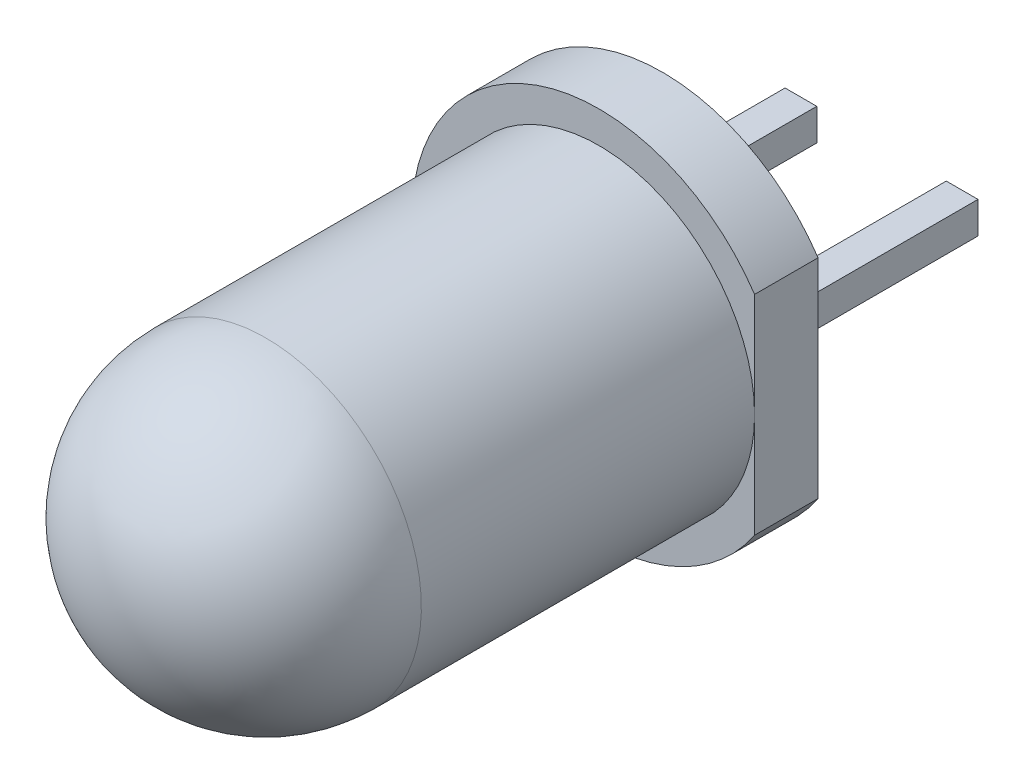
ISO-10303-21;
HEADER;
FILE_DESCRIPTION(('STEP AP214'),'2;1');
FILE_NAME('part.step','',(''),(''),'','','');
FILE_SCHEMA(('AUTOMOTIVE_DESIGN { 1 0 10303 214 1 1 1 1 }'));
ENDSEC;
DATA;
#1=APPLICATION_CONTEXT('core data for automotive mechanical design processes');
#2=APPLICATION_PROTOCOL_DEFINITION('international standard','automotive_design',2000,#1);
#3=PRODUCT_CONTEXT('',#1,'mechanical');
#4=PRODUCT('Part','Part','',(#3));
#5=PRODUCT_RELATED_PRODUCT_CATEGORY('part','',(#4));
#6=PRODUCT_DEFINITION_FORMATION('','',#4);
#7=PRODUCT_DEFINITION_CONTEXT('part definition',#1,'design');
#8=PRODUCT_DEFINITION('design','',#6,#7);
#9=PRODUCT_DEFINITION_SHAPE('','',#8);
#10=(LENGTH_UNIT() NAMED_UNIT(*) SI_UNIT(.MILLI.,.METRE.));
#11=(NAMED_UNIT(*) PLANE_ANGLE_UNIT() SI_UNIT($,.RADIAN.));
#12=(NAMED_UNIT(*) SI_UNIT($,.STERADIAN.) SOLID_ANGLE_UNIT());
#13=UNCERTAINTY_MEASURE_WITH_UNIT(LENGTH_MEASURE(1.E-05),#10,'distance_accuracy_value','');
#14=(GEOMETRIC_REPRESENTATION_CONTEXT(3) GLOBAL_UNCERTAINTY_ASSIGNED_CONTEXT((#13)) GLOBAL_UNIT_ASSIGNED_CONTEXT((#10,
#11,#12)) REPRESENTATION_CONTEXT('',''));
#15=CARTESIAN_POINT('',(0.,0.,0.));
#16=DIRECTION('',(0.,0.,1.));
#17=DIRECTION('',(1.,0.,0.));
#18=AXIS2_PLACEMENT_3D('',#15,#16,#17);
#19=CARTESIAN_POINT('',(0.0200000000000061,0.025000000000007,6.83));
#20=DIRECTION('',(0.,0.,1.));
#21=DIRECTION('',(-1.,0.,0.));
#22=AXIS2_PLACEMENT_3D('',#19,#20,#21);
#23=SPHERICAL_SURFACE('',#22,2.45);
#24=CARTESIAN_POINT('',(0.0200000000000061,0.02499999999999,6.83000000000002));
#25=DIRECTION('',(0.,0.,1.));
#26=DIRECTION('',(0.,-1.,0.));
#27=AXIS2_PLACEMENT_3D('',#24,#25,#26);
#28=CIRCLE('',#27,2.45000000000001);
#29=CARTESIAN_POINT('',(0.020000000000007,-2.42500000000002,6.83000000000002));
#30=VERTEX_POINT('',#29);
#31=EDGE_CURVE('E232',#30,#30,#28,.F.);
#32=ORIENTED_EDGE('',*,*,#31,.F.);
#33=EDGE_LOOP('',(#32));
#34=FACE_BOUND('',#33,.T.);
#35=ADVANCED_FACE('F16',(#34),#23,.T.);
#36=CARTESIAN_POINT('',(1.54000000000001,0.276000000000011,0.120078108140042));
#37=DIRECTION('',(1.,0.,0.));
#38=DIRECTION('',(0.,-1.,0.));
#39=AXIS2_PLACEMENT_3D('',#36,#37,#38);
#40=PLANE('',#39);
#41=CARTESIAN_POINT('',(1.54000000000001,0.275000000000009,0.119078108140043));
#42=CARTESIAN_POINT('',(1.54000000000001,0.233549365504056,0.112515302307332));
#43=CARTESIAN_POINT('',(1.54000000000001,0.191840043945226,0.107590634626955));
#44=CARTESIAN_POINT('',(1.54000000000001,0.10841943311385,0.1010528729667));
#45=CARTESIAN_POINT('',(1.54000000000001,0.0667097165569304,0.0994197062795764));
#46=CARTESIAN_POINT('',(1.54000000000001,-0.0167097165569095,0.0994197062795764));
#47=CARTESIAN_POINT('',(1.54000000000001,-0.0584194331138295,0.1010528729667));
#48=CARTESIAN_POINT('',(1.54000000000001,-0.141840043945206,0.107590634626955));
#49=CARTESIAN_POINT('',(1.54000000000001,-0.183549365504036,0.112515302307332));
#50=CARTESIAN_POINT('',(1.54000000000001,-0.224999999999989,0.119078108140043));
#51=B_SPLINE_CURVE_WITH_KNOTS('',3,(#41,#42,#43,#44,#45,#46,#47,#48,#49,#50),.UNSPECIFIED.,.F.,
.F.,(4,2,2,2,4),(0.,0.125867399079701,0.250964864158874,0.376062329238048,0.501929728317749),.UNSPECIFIED.);
#52=CARTESIAN_POINT('',(1.54000000000001,0.27500000000001,0.119078108140041));
#53=VERTEX_POINT('',#52);
#54=CARTESIAN_POINT('',(1.54000000000001,-0.22499999999999,0.119078108140043));
#55=VERTEX_POINT('',#54);
#56=EDGE_CURVE('E21',#53,#55,#51,.T.);
#57=ORIENTED_EDGE('',*,*,#56,.T.);
#58=DIRECTION('',(0.,0.,1.));
#59=VECTOR('',#58,1.);
#60=CARTESIAN_POINT('',(1.54000000000001,-0.22499999999999,-1.37546094592998));
#61=LINE('',#60,#59);
#62=CARTESIAN_POINT('',(1.54000000000001,-0.224999999999989,-2.87));
#63=VERTEX_POINT('',#62);
#64=EDGE_CURVE('E221',#63,#55,#61,.T.);
#65=ORIENTED_EDGE('',*,*,#64,.F.);
#66=DIRECTION('',(0.,-1.,0.));
#67=VECTOR('',#66,1.);
#68=CARTESIAN_POINT('',(1.54000000000001,0.0250000000000113,-2.87));
#69=LINE('',#68,#67);
#70=CARTESIAN_POINT('',(1.54000000000001,0.275000000000011,-2.87));
#71=VERTEX_POINT('',#70);
#72=EDGE_CURVE('E94',#71,#63,#69,.T.);
#73=ORIENTED_EDGE('',*,*,#72,.F.);
#74=DIRECTION('',(0.,0.,-1.));
#75=VECTOR('',#74,1.);
#76=CARTESIAN_POINT('',(1.54000000000001,0.275000000000011,-1.37546094592998));
#77=LINE('',#76,#75);
#78=EDGE_CURVE('E206',#53,#71,#77,.T.);
#79=ORIENTED_EDGE('',*,*,#78,.F.);
#80=EDGE_LOOP('',(#57,#65,#73,#79));
#81=FACE_BOUND('',#80,.T.);
#82=ADVANCED_FACE('F239',(#81),#40,.T.);
#83=CARTESIAN_POINT('',(0.0200000000000061,0.0249999999999901,6.83000000000002));
#84=DIRECTION('',(0.,0.,1.));
#85=DIRECTION('',(0.,-1.,0.));
#86=AXIS2_PLACEMENT_3D('',#83,#84,#85);
#87=CYLINDRICAL_SURFACE('',#86,2.45000000000001);
#88=CARTESIAN_POINT('',(0.0200000000000052,0.024999999999992,1.58));
#89=DIRECTION('',(0.,0.,1.));
#90=DIRECTION('',(0.,-1.,0.));
#91=AXIS2_PLACEMENT_3D('',#88,#89,#90);
#92=CIRCLE('',#91,2.45000000000001);
#93=CARTESIAN_POINT('',(2.47000000000001,0.0250000000000017,1.58));
#94=VERTEX_POINT('',#93);
#95=EDGE_CURVE('E202',#94,#94,#92,.F.);
#96=ORIENTED_EDGE('',*,*,#95,.F.);
#97=EDGE_LOOP('',(#96));
#98=FACE_BOUND('',#97,.T.);
#99=ORIENTED_EDGE('',*,*,#31,.T.);
#100=EDGE_LOOP('',(#99));
#101=FACE_BOUND('',#100,.T.);
#102=ADVANCED_FACE('F405',(#98,#101),#87,.T.);
#103=CARTESIAN_POINT('',(1.039,0.276000000000012,-2.87));
#104=DIRECTION('',(0.,0.,-1.));
#105=DIRECTION('',(1.,0.,0.));
#106=AXIS2_PLACEMENT_3D('',#103,#104,#105);
#107=PLANE('',#106);
#108=DIRECTION('',(1.,0.,0.));
#109=VECTOR('',#108,1.);
#110=CARTESIAN_POINT('',(1.29000000000001,-0.224999999999989,-2.87));
#111=LINE('',#110,#109);
#112=CARTESIAN_POINT('',(1.04000000000001,-0.224999999999989,-2.87));
#113=VERTEX_POINT('',#112);
#114=EDGE_CURVE('E224',#113,#63,#111,.T.);
#115=ORIENTED_EDGE('',*,*,#114,.F.);
#116=DIRECTION('',(0.,-1.,0.));
#117=VECTOR('',#116,1.);
#118=CARTESIAN_POINT('',(1.04000000000001,0.0250000000000111,-2.87));
#119=LINE('',#118,#117);
#120=CARTESIAN_POINT('',(1.04000000000001,0.27500000000001,-2.87));
#121=VERTEX_POINT('',#120);
#122=EDGE_CURVE('E197',#121,#113,#119,.T.);
#123=ORIENTED_EDGE('',*,*,#122,.F.);
#124=DIRECTION('',(-1.,0.,0.));
#125=VECTOR('',#124,1.);
#126=CARTESIAN_POINT('',(1.29000000000001,0.275000000000011,-2.87));
#127=LINE('',#126,#125);
#128=EDGE_CURVE('E212',#71,#121,#127,.T.);
#129=ORIENTED_EDGE('',*,*,#128,.F.);
#130=ORIENTED_EDGE('',*,*,#72,.T.);
#131=EDGE_LOOP('',(#115,#123,#129,#130));
#132=FACE_BOUND('',#131,.T.);
#133=ADVANCED_FACE('F244',(#132),#107,.T.);
#134=CARTESIAN_POINT('',(1.54100000000001,-0.224999999999989,-2.871));
#135=DIRECTION('',(0.,-1.,0.));
#136=DIRECTION('',(0.,0.,1.));
#137=AXIS2_PLACEMENT_3D('',#134,#135,#136);
#138=PLANE('',#137);
#139=CARTESIAN_POINT('',(1.54000000000001,-0.22499999999999,0.119078108140043));
#140=CARTESIAN_POINT('',(1.49854936550406,-0.22499999999999,0.112515302307332));
#141=CARTESIAN_POINT('',(1.45684004394523,-0.22499999999999,0.107590634626955));
#142=CARTESIAN_POINT('',(1.37341943311385,-0.22499999999999,0.101052872966699));
#143=CARTESIAN_POINT('',(1.33170971655693,-0.22499999999999,0.0994197062795753));
#144=CARTESIAN_POINT('',(1.24829028344309,-0.22499999999999,0.0994197062795747));
#145=CARTESIAN_POINT('',(1.20658056688617,-0.22499999999999,0.101052872966698));
#146=CARTESIAN_POINT('',(1.12315995605479,-0.22499999999999,0.107590634626953));
#147=CARTESIAN_POINT('',(1.08145063449596,-0.22499999999999,0.112515302307329));
#148=CARTESIAN_POINT('',(1.04000000000001,-0.22499999999999,0.11907810814004));
#149=B_SPLINE_CURVE_WITH_KNOTS('',3,(#139,#140,#141,#142,#143,#144,#145,#146,#147,#148),
.UNSPECIFIED.,.F.,.F.,(4,2,2,2,4),(0.,0.125867399079701,0.250964864158875,0.376062329238048,
0.50192972831775),.UNSPECIFIED.);
#150=CARTESIAN_POINT('',(1.04000000000001,-0.22499999999999,0.119078108140039));
#151=VERTEX_POINT('',#150);
#152=EDGE_CURVE('E87',#55,#151,#149,.T.);
#153=ORIENTED_EDGE('',*,*,#152,.T.);
#154=DIRECTION('',(0.,0.,1.));
#155=VECTOR('',#154,1.);
#156=CARTESIAN_POINT('',(1.04000000000001,-0.22499999999999,-1.37546094592998));
#157=LINE('',#156,#155);
#158=EDGE_CURVE('E192',#113,#151,#157,.T.);
#159=ORIENTED_EDGE('',*,*,#158,.F.);
#160=ORIENTED_EDGE('',*,*,#114,.T.);
#161=ORIENTED_EDGE('',*,*,#64,.T.);
#162=EDGE_LOOP('',(#153,#159,#160,#161));
#163=FACE_BOUND('',#162,.T.);
#164=ADVANCED_FACE('F242',(#163),#138,.T.);
#165=CARTESIAN_POINT('',(1.54100000000001,0.27500000000001,0.12007810814004));
#166=DIRECTION('',(0.,1.,0.));
#167=DIRECTION('',(0.,0.,-1.));
#168=AXIS2_PLACEMENT_3D('',#165,#166,#167);
#169=PLANE('',#168);
#170=CARTESIAN_POINT('',(1.04000000000001,0.27500000000001,0.11907810814004));
#171=CARTESIAN_POINT('',(1.08145063449596,0.27500000000001,0.112515302307328));
#172=CARTESIAN_POINT('',(1.12315995605479,0.27500000000001,0.107590634626952));
#173=CARTESIAN_POINT('',(1.20658056688617,0.27500000000001,0.101052872966698));
#174=CARTESIAN_POINT('',(1.24829028344309,0.27500000000001,0.0994197062795745));
#175=CARTESIAN_POINT('',(1.33170971655693,0.27500000000001,0.099419706279575));
#176=CARTESIAN_POINT('',(1.37341943311385,0.27500000000001,0.101052872966699));
#177=CARTESIAN_POINT('',(1.45684004394523,0.27500000000001,0.107590634626954));
#178=CARTESIAN_POINT('',(1.49854936550406,0.27500000000001,0.112515302307331));
#179=CARTESIAN_POINT('',(1.54000000000001,0.27500000000001,0.119078108140043));
#180=B_SPLINE_CURVE_WITH_KNOTS('',3,(#170,#171,#172,#173,#174,#175,#176,#177,#178,#179),
.UNSPECIFIED.,.F.,.F.,(4,2,2,2,4),(0.,0.125867399079702,0.250964864158875,0.376062329238049,
0.50192972831775),.UNSPECIFIED.);
#181=CARTESIAN_POINT('',(1.04000000000001,0.27500000000001,0.119078108140039));
#182=VERTEX_POINT('',#181);
#183=EDGE_CURVE('E209',#182,#53,#180,.T.);
#184=ORIENTED_EDGE('',*,*,#183,.T.);
#185=ORIENTED_EDGE('',*,*,#78,.T.);
#186=ORIENTED_EDGE('',*,*,#128,.T.);
#187=DIRECTION('',(0.,0.,-1.));
#188=VECTOR('',#187,1.);
#189=CARTESIAN_POINT('',(1.04000000000001,0.27500000000001,-1.37546094592998));
#190=LINE('',#189,#188);
#191=EDGE_CURVE('E189',#182,#121,#190,.T.);
#192=ORIENTED_EDGE('',*,*,#191,.F.);
#193=EDGE_LOOP('',(#184,#185,#186,#192));
#194=FACE_BOUND('',#193,.T.);
#195=ADVANCED_FACE('F248',(#194),#169,.T.);
#196=CARTESIAN_POINT('',(2.47100000000002,3.48457168699212,1.58));
#197=DIRECTION('',(0.,0.,1.));
#198=DIRECTION('',(-1.,0.,0.));
#199=AXIS2_PLACEMENT_3D('',#196,#197,#198);
#200=PLANE('',#199);
#201=ORIENTED_EDGE('',*,*,#95,.T.);
#202=DIRECTION('',(0.,1.,0.));
#203=VECTOR('',#202,1.);
#204=CARTESIAN_POINT('',(2.47000000000001,0.02500000000001,1.58));
#205=LINE('',#204,#203);
#206=CARTESIAN_POINT('',(2.47000000000001,1.66816767251549,1.58));
#207=VERTEX_POINT('',#206);
#208=EDGE_CURVE('E200',#94,#207,#205,.T.);
#209=ORIENTED_EDGE('',*,*,#208,.T.);
#210=CARTESIAN_POINT('',(0.0200000000000046,0.0249999999999964,1.58));
#211=DIRECTION('',(0.,0.,1.));
#212=DIRECTION('',(0.,-1.,0.));
#213=AXIS2_PLACEMENT_3D('',#210,#211,#212);
#214=CIRCLE('',#213,2.94999999999999);
#215=CARTESIAN_POINT('',(2.47000000000001,-1.61816767251548,1.58));
#216=VERTEX_POINT('',#215);
#217=EDGE_CURVE('E188',#216,#207,#214,.F.);
#218=ORIENTED_EDGE('',*,*,#217,.F.);
#219=DIRECTION('',(0.,1.,0.));
#220=VECTOR('',#219,1.);
#221=CARTESIAN_POINT('',(2.47000000000001,0.02500000000001,1.58));
#222=LINE('',#221,#220);
#223=EDGE_CURVE('E203',#216,#94,#222,.T.);
#224=ORIENTED_EDGE('',*,*,#223,.T.);
#225=EDGE_LOOP('',(#201,#209,#218,#224));
#226=FACE_BOUND('',#225,.T.);
#227=ADVANCED_FACE('F267',(#226),#200,.T.);
#228=CARTESIAN_POINT('',(1.04000000000001,-0.22599999999999,0.120078108140038));
#229=DIRECTION('',(-1.,0.,0.));
#230=DIRECTION('',(0.,1.,0.));
#231=AXIS2_PLACEMENT_3D('',#228,#229,#230);
#232=PLANE('',#231);
#233=ORIENTED_EDGE('',*,*,#158,.T.);
#234=CARTESIAN_POINT('',(1.04000000000001,0.27500000000001,0.11907810814004));
#235=CARTESIAN_POINT('',(1.04000000000001,0.233549365504057,0.112515302307328));
#236=CARTESIAN_POINT('',(1.04000000000001,0.191840043945227,0.107590634626952));
#237=CARTESIAN_POINT('',(1.04000000000001,0.108419433113851,0.101052872966697));
#238=CARTESIAN_POINT('',(1.04000000000001,0.0667097165569315,0.0994197062795734));
#239=CARTESIAN_POINT('',(1.04000000000001,-0.0167097165569086,0.0994197062795733));
#240=CARTESIAN_POINT('',(1.04000000000001,-0.0584194331138288,0.101052872966697));
#241=CARTESIAN_POINT('',(1.04000000000001,-0.141840043945206,0.107590634626952));
#242=CARTESIAN_POINT('',(1.04000000000001,-0.183549365504036,0.112515302307328));
#243=CARTESIAN_POINT('',(1.04000000000001,-0.224999999999989,0.11907810814004));
#244=B_SPLINE_CURVE_WITH_KNOTS('',3,(#234,#235,#236,#237,#238,#239,#240,#241,#242,#243),
.UNSPECIFIED.,.F.,.F.,(4,2,2,2,4),(0.,0.125867399079701,0.250964864158874,0.376062329238048,
0.50192972831775),.UNSPECIFIED.);
#245=EDGE_CURVE('E184',#182,#151,#244,.T.);
#246=ORIENTED_EDGE('',*,*,#245,.F.);
#247=ORIENTED_EDGE('',*,*,#191,.T.);
#248=ORIENTED_EDGE('',*,*,#122,.T.);
#249=EDGE_LOOP('',(#233,#246,#247,#248));
#250=FACE_BOUND('',#249,.T.);
#251=ADVANCED_FACE('F250',(#250),#232,.T.);
#252=CARTESIAN_POINT('',(0.0200000000000046,0.0249999999999964,1.58));
#253=DIRECTION('',(0.,0.,1.));
#254=DIRECTION('',(0.,-1.,0.));
#255=AXIS2_PLACEMENT_3D('',#252,#253,#254);
#256=CYLINDRICAL_SURFACE('',#255,2.94999999999999);
#257=CARTESIAN_POINT('',(0.0200000000000046,0.0249999999999965,0.580000000000007));
#258=DIRECTION('',(0.,0.,1.));
#259=DIRECTION('',(0.,-1.,0.));
#260=AXIS2_PLACEMENT_3D('',#257,#258,#259);
#261=CIRCLE('',#260,2.94999999999999);
#262=CARTESIAN_POINT('',(2.47000000000001,-1.61816767251548,0.580000000000007));
#263=VERTEX_POINT('',#262);
#264=CARTESIAN_POINT('',(2.47000000000001,1.66816767251549,0.580000000000007));
#265=VERTEX_POINT('',#264);
#266=EDGE_CURVE('E178',#263,#265,#261,.F.);
#267=ORIENTED_EDGE('',*,*,#266,.F.);
#268=DIRECTION('',(0.,0.,-1.));
#269=VECTOR('',#268,1.);
#270=CARTESIAN_POINT('',(2.47000000000001,-1.61816767251549,1.08));
#271=LINE('',#270,#269);
#272=EDGE_CURVE('E185',#216,#263,#271,.T.);
#273=ORIENTED_EDGE('',*,*,#272,.F.);
#274=ORIENTED_EDGE('',*,*,#217,.T.);
#275=DIRECTION('',(0.,0.,1.));
#276=VECTOR('',#275,1.);
#277=CARTESIAN_POINT('',(2.47000000000001,1.66816767251551,1.08));
#278=LINE('',#277,#276);
#279=EDGE_CURVE('E181',#265,#207,#278,.T.);
#280=ORIENTED_EDGE('',*,*,#279,.F.);
#281=EDGE_LOOP('',(#267,#273,#274,#280));
#282=FACE_BOUND('',#281,.T.);
#283=ADVANCED_FACE('F266',(#282),#256,.T.);
#284=CARTESIAN_POINT('',(2.47000000000001,1.66916767251551,1.581));
#285=DIRECTION('',(1.,0.,0.));
#286=DIRECTION('',(0.,-1.,0.));
#287=AXIS2_PLACEMENT_3D('',#284,#285,#286);
#288=PLANE('',#287);
#289=ORIENTED_EDGE('',*,*,#208,.F.);
#290=ORIENTED_EDGE('',*,*,#223,.F.);
#291=ORIENTED_EDGE('',*,*,#272,.T.);
#292=DIRECTION('',(0.,-1.,0.));
#293=VECTOR('',#292,1.);
#294=CARTESIAN_POINT('',(2.47000000000001,0.02500000000001,0.580000000000008));
#295=LINE('',#294,#293);
#296=EDGE_CURVE('E176',#265,#263,#295,.T.);
#297=ORIENTED_EDGE('',*,*,#296,.F.);
#298=ORIENTED_EDGE('',*,*,#279,.T.);
#299=EDGE_LOOP('',(#289,#290,#291,#297,#298));
#300=FACE_BOUND('',#299,.T.);
#301=ADVANCED_FACE('F269',(#300),#288,.T.);
#302=CARTESIAN_POINT('',(1.29,0.0250000000000116,1.6989));
#303=DIRECTION('',(0.,0.,1.));
#304=DIRECTION('',(-1.,0.,0.));
#305=AXIS2_PLACEMENT_3D('',#302,#303,#304);
#306=SPHERICAL_SURFACE('',#305,1.61889999999999);
#307=ORIENTED_EDGE('',*,*,#245,.T.);
#308=ORIENTED_EDGE('',*,*,#152,.F.);
#309=ORIENTED_EDGE('',*,*,#56,.F.);
#310=ORIENTED_EDGE('',*,*,#183,.F.);
#311=EDGE_LOOP('',(#307,#308,#309,#310));
#312=FACE_BOUND('',#311,.T.);
#313=CARTESIAN_POINT('',(1.29,0.0250000000000119,0.580000000000008));
#314=DIRECTION('',(0.,0.,1.));
#315=DIRECTION('',(0.,-1.,0.));
#316=AXIS2_PLACEMENT_3D('',#313,#314,#315);
#317=CIRCLE('',#316,1.17);
#318=CARTESIAN_POINT('',(1.29,-1.14499999999999,0.580000000000007));
#319=VERTEX_POINT('',#318);
#320=EDGE_CURVE('E173',#319,#319,#317,.T.);
#321=ORIENTED_EDGE('',*,*,#320,.F.);
#322=EDGE_LOOP('',(#321));
#323=FACE_BOUND('',#322,.T.);
#324=ADVANCED_FACE('F152',(#312,#323),#306,.T.);
#325=CARTESIAN_POINT('',(-2.931,3.48457168699212,0.580000000000008));
#326=DIRECTION('',(0.,0.,-1.));
#327=DIRECTION('',(1.,0.,0.));
#328=AXIS2_PLACEMENT_3D('',#325,#326,#327);
#329=PLANE('',#328);
#330=ORIENTED_EDGE('',*,*,#320,.T.);
#331=EDGE_LOOP('',(#330));
#332=FACE_BOUND('',#331,.T.);
#333=CARTESIAN_POINT('',(-1.24999999999999,0.0250000000000057,0.580000000000008));
#334=DIRECTION('',(0.,0.,-1.));
#335=DIRECTION('',(0.,1.,0.));
#336=AXIS2_PLACEMENT_3D('',#333,#334,#335);
#337=CIRCLE('',#336,1.17);
#338=CARTESIAN_POINT('',(-1.24999999999999,1.195,0.580000000000008));
#339=VERTEX_POINT('',#338);
#340=EDGE_CURVE('E127',#339,#339,#337,.T.);
#341=ORIENTED_EDGE('',*,*,#340,.F.);
#342=EDGE_LOOP('',(#341));
#343=FACE_BOUND('',#342,.T.);
#344=ORIENTED_EDGE('',*,*,#266,.T.);
#345=ORIENTED_EDGE('',*,*,#296,.T.);
#346=EDGE_LOOP('',(#344,#345));
#347=FACE_BOUND('',#346,.T.);
#348=ADVANCED_FACE('F273',(#332,#343,#347),#329,.T.);
#349=CARTESIAN_POINT('',(-1.49999999999999,-0.22599999999999,0.120078108140038));
#350=DIRECTION('',(-1.,0.,0.));
#351=DIRECTION('',(0.,1.,0.));
#352=AXIS2_PLACEMENT_3D('',#349,#350,#351);
#353=PLANE('',#352);
#354=DIRECTION('',(0.,0.,-1.));
#355=VECTOR('',#354,1.);
#356=CARTESIAN_POINT('',(-1.49999999999999,-0.22499999999999,-1.37546094592998));
#357=LINE('',#356,#355);
#358=CARTESIAN_POINT('',(-1.49999999999999,-0.224999999999989,0.119078108140042));
#359=VERTEX_POINT('',#358);
#360=CARTESIAN_POINT('',(-1.49999999999999,-0.22499999999999,-2.87));
#361=VERTEX_POINT('',#360);
#362=EDGE_CURVE('E121',#359,#361,#357,.T.);
#363=ORIENTED_EDGE('',*,*,#362,.F.);
#364=CARTESIAN_POINT('',(-1.49999999999999,0.275000000000009,0.119078108140049));
#365=CARTESIAN_POINT('',(-1.49999999999999,0.233549365504055,0.112515302307337));
#366=CARTESIAN_POINT('',(-1.49999999999999,0.191840043945224,0.10759063462696));
#367=CARTESIAN_POINT('',(-1.49999999999999,0.108419433113847,0.101052872966705));
#368=CARTESIAN_POINT('',(-1.49999999999999,0.0667097165569263,0.0994197062795812));
#369=CARTESIAN_POINT('',(-1.49999999999999,-0.0167097165569131,0.0994197062795812));
#370=CARTESIAN_POINT('',(-1.49999999999999,-0.058419433113832,0.101052872966705));
#371=CARTESIAN_POINT('',(-1.49999999999999,-0.141840043945206,0.107590634626959));
#372=CARTESIAN_POINT('',(-1.49999999999999,-0.183549365504035,0.112515302307335));
#373=CARTESIAN_POINT('',(-1.49999999999999,-0.224999999999987,0.119078108140047));
#374=B_SPLINE_CURVE_WITH_KNOTS('',3,(#364,#365,#366,#367,#368,#369,#370,#371,#372,#373),
.UNSPECIFIED.,.F.,.F.,(4,2,2,2,4),(0.,0.125867399079703,0.250964864158878,0.376062329238049,
0.501929728317747),.UNSPECIFIED.);
#375=CARTESIAN_POINT('',(-1.49999999999999,0.275000000000009,0.119078108140043));
#376=VERTEX_POINT('',#375);
#377=EDGE_CURVE('E284',#376,#359,#374,.T.);
#378=ORIENTED_EDGE('',*,*,#377,.F.);
#379=DIRECTION('',(0.,0.,1.));
#380=VECTOR('',#379,1.);
#381=CARTESIAN_POINT('',(-1.49999999999999,0.27500000000001,-1.37546094592998));
#382=LINE('',#381,#380);
#383=CARTESIAN_POINT('',(-1.49999999999999,0.27500000000001,-2.87));
#384=VERTEX_POINT('',#383);
#385=EDGE_CURVE('E163',#384,#376,#382,.T.);
#386=ORIENTED_EDGE('',*,*,#385,.F.);
#387=DIRECTION('',(0.,1.,0.));
#388=VECTOR('',#387,1.);
#389=CARTESIAN_POINT('',(-1.49999999999999,0.0250000000000107,-2.87));
#390=LINE('',#389,#388);
#391=EDGE_CURVE('E169',#361,#384,#390,.T.);
#392=ORIENTED_EDGE('',*,*,#391,.F.);
#393=EDGE_LOOP('',(#363,#378,#386,#392));
#394=FACE_BOUND('',#393,.T.);
#395=ADVANCED_FACE('F276',(#394),#353,.T.);
#396=CARTESIAN_POINT('',(-1.501,0.276000000000012,-2.87));
#397=DIRECTION('',(0.,0.,-1.));
#398=DIRECTION('',(1.,0.,0.));
#399=AXIS2_PLACEMENT_3D('',#396,#397,#398);
#400=PLANE('',#399);
#401=ORIENTED_EDGE('',*,*,#391,.T.);
#402=DIRECTION('',(-1.,0.,0.));
#403=VECTOR('',#402,1.);
#404=CARTESIAN_POINT('',(-1.24999999999999,0.275000000000011,-2.87));
#405=LINE('',#404,#403);
#406=CARTESIAN_POINT('',(-0.999999999999994,0.275000000000011,-2.87));
#407=VERTEX_POINT('',#406);
#408=EDGE_CURVE('E116',#407,#384,#405,.T.);
#409=ORIENTED_EDGE('',*,*,#408,.F.);
#410=DIRECTION('',(0.,1.,0.));
#411=VECTOR('',#410,1.);
#412=CARTESIAN_POINT('',(-0.999999999999994,0.0250000000000105,-2.87));
#413=LINE('',#412,#411);
#414=CARTESIAN_POINT('',(-0.999999999999994,-0.22499999999999,-2.87));
#415=VERTEX_POINT('',#414);
#416=EDGE_CURVE('E110',#415,#407,#413,.T.);
#417=ORIENTED_EDGE('',*,*,#416,.F.);
#418=DIRECTION('',(1.,0.,0.));
#419=VECTOR('',#418,1.);
#420=CARTESIAN_POINT('',(-1.24999999999999,-0.22499999999999,-2.87));
#421=LINE('',#420,#419);
#422=EDGE_CURVE('E113',#361,#415,#421,.T.);
#423=ORIENTED_EDGE('',*,*,#422,.F.);
#424=EDGE_LOOP('',(#401,#409,#417,#423));
#425=FACE_BOUND('',#424,.T.);
#426=ADVANCED_FACE('F112',(#425),#400,.T.);
#427=CARTESIAN_POINT('',(-0.998999999999994,0.27500000000001,0.120078108140049));
#428=DIRECTION('',(0.,1.,0.));
#429=DIRECTION('',(0.,0.,-1.));
#430=AXIS2_PLACEMENT_3D('',#427,#428,#429);
#431=PLANE('',#430);
#432=CARTESIAN_POINT('',(-0.999999999999995,0.275000000000011,0.119078108140048));
#433=CARTESIAN_POINT('',(-1.04145063449595,0.275000000000011,0.112515302307336));
#434=CARTESIAN_POINT('',(-1.08315995605478,0.27500000000001,0.10759063462696));
#435=CARTESIAN_POINT('',(-1.16658056688615,0.27500000000001,0.101052872966706));
#436=CARTESIAN_POINT('',(-1.20829028344307,0.27500000000001,0.0994197062795819));
#437=CARTESIAN_POINT('',(-1.29170971655691,0.27500000000001,0.0994197062795819));
#438=CARTESIAN_POINT('',(-1.33341943311383,0.27500000000001,0.101052872966706));
#439=CARTESIAN_POINT('',(-1.41684004394521,0.27500000000001,0.107590634626961));
#440=CARTESIAN_POINT('',(-1.45854936550404,0.27500000000001,0.112515302307337));
#441=CARTESIAN_POINT('',(-1.49999999999999,0.27500000000001,0.119078108140049));
#442=B_SPLINE_CURVE_WITH_KNOTS('',3,(#432,#433,#434,#435,#436,#437,#438,#439,#440,#441),
.UNSPECIFIED.,.F.,.F.,(4,2,2,2,4),(0.,0.125867399079699,0.25096486415887,0.376062329238043,
0.501929728317744),.UNSPECIFIED.);
#443=CARTESIAN_POINT('',(-0.999999999999994,0.27500000000001,0.119078108140048));
#444=VERTEX_POINT('',#443);
#445=EDGE_CURVE('E165',#444,#376,#442,.T.);
#446=ORIENTED_EDGE('',*,*,#445,.F.);
#447=DIRECTION('',(0.,0.,1.));
#448=VECTOR('',#447,1.);
#449=CARTESIAN_POINT('',(-0.999999999999994,0.27500000000001,-1.37546094592998));
#450=LINE('',#449,#448);
#451=EDGE_CURVE('E120',#407,#444,#450,.T.);
#452=ORIENTED_EDGE('',*,*,#451,.F.);
#453=ORIENTED_EDGE('',*,*,#408,.T.);
#454=ORIENTED_EDGE('',*,*,#385,.T.);
#455=EDGE_LOOP('',(#446,#452,#453,#454));
#456=FACE_BOUND('',#455,.T.);
#457=ADVANCED_FACE('F150',(#456),#431,.T.);
#458=CARTESIAN_POINT('',(-1.24999999999999,0.0250000000000054,1.69890000000002));
#459=DIRECTION('',(0.,0.,-1.));
#460=DIRECTION('',(-1.,0.,0.));
#461=AXIS2_PLACEMENT_3D('',#458,#459,#460);
#462=SPHERICAL_SURFACE('',#461,1.61890000000001);
#463=ORIENTED_EDGE('',*,*,#340,.T.);
#464=EDGE_LOOP('',(#463));
#465=FACE_BOUND('',#464,.T.);
#466=ORIENTED_EDGE('',*,*,#377,.T.);
#467=CARTESIAN_POINT('',(-0.999999999999995,-0.224999999999991,0.119078108140047));
#468=CARTESIAN_POINT('',(-1.04145063449595,-0.22499999999999,0.112515302307335));
#469=CARTESIAN_POINT('',(-1.08315995605478,-0.22499999999999,0.107590634626959));
#470=CARTESIAN_POINT('',(-1.16658056688615,-0.224999999999991,0.101052872966704));
#471=CARTESIAN_POINT('',(-1.20829028344307,-0.224999999999991,0.0994197062795806));
#472=CARTESIAN_POINT('',(-1.29170971655691,-0.224999999999991,0.0994197062795806));
#473=CARTESIAN_POINT('',(-1.33341943311383,-0.224999999999991,0.101052872966704));
#474=CARTESIAN_POINT('',(-1.41684004394521,-0.224999999999991,0.107590634626959));
#475=CARTESIAN_POINT('',(-1.45854936550403,-0.22499999999999,0.112515302307335));
#476=CARTESIAN_POINT('',(-1.49999999999999,-0.224999999999991,0.119078108140047));
#477=B_SPLINE_CURVE_WITH_KNOTS('',3,(#467,#468,#469,#470,#471,#472,#473,#474,#475,#476),
.UNSPECIFIED.,.F.,.F.,(4,2,2,2,4),(0.,0.125867399079699,0.250964864158871,0.376062329238043,
0.501929728317744),.UNSPECIFIED.);
#478=CARTESIAN_POINT('',(-0.999999999999994,-0.22499999999999,0.119078108140044));
#479=VERTEX_POINT('',#478);
#480=EDGE_CURVE('E42',#479,#359,#477,.T.);
#481=ORIENTED_EDGE('',*,*,#480,.F.);
#482=CARTESIAN_POINT('',(-0.999999999999993,0.275000000000009,0.119078108140048));
#483=CARTESIAN_POINT('',(-0.999999999999994,0.233549365504056,0.112515302307336));
#484=CARTESIAN_POINT('',(-0.999999999999994,0.191840043945226,0.10759063462696));
#485=CARTESIAN_POINT('',(-0.999999999999994,0.10841943311385,0.101052872966705));
#486=CARTESIAN_POINT('',(-0.999999999999994,0.0667097165569298,0.0994197062795806));
#487=CARTESIAN_POINT('',(-0.999999999999994,-0.0167097165569101,0.0994197062795804));
#488=CARTESIAN_POINT('',(-0.999999999999994,-0.05841943311383,0.101052872966704));
#489=CARTESIAN_POINT('',(-0.999999999999994,-0.141840043945206,0.107590634626959));
#490=CARTESIAN_POINT('',(-0.999999999999994,-0.183549365504036,0.112515302307335));
#491=CARTESIAN_POINT('',(-0.999999999999994,-0.22499999999999,0.119078108140047));
#492=B_SPLINE_CURVE_WITH_KNOTS('',3,(#482,#483,#484,#485,#486,#487,#488,#489,#490,#491),
.UNSPECIFIED.,.F.,.F.,(4,2,2,2,4),(0.,0.125867399079701,0.250964864158874,0.376062329238048,
0.501929728317749),.UNSPECIFIED.);
#493=EDGE_CURVE('E33',#444,#479,#492,.T.);
#494=ORIENTED_EDGE('',*,*,#493,.F.);
#495=ORIENTED_EDGE('',*,*,#445,.T.);
#496=EDGE_LOOP('',(#466,#481,#494,#495));
#497=FACE_BOUND('',#496,.T.);
#498=ADVANCED_FACE('F146',(#465,#497),#462,.T.);
#499=CARTESIAN_POINT('',(-0.998999999999993,-0.224999999999989,-2.871));
#500=DIRECTION('',(0.,-1.,0.));
#501=DIRECTION('',(0.,0.,1.));
#502=AXIS2_PLACEMENT_3D('',#499,#500,#501);
#503=PLANE('',#502);
#504=ORIENTED_EDGE('',*,*,#480,.T.);
#505=ORIENTED_EDGE('',*,*,#362,.T.);
#506=ORIENTED_EDGE('',*,*,#422,.T.);
#507=DIRECTION('',(0.,0.,-1.));
#508=VECTOR('',#507,1.);
#509=CARTESIAN_POINT('',(-0.999999999999994,-0.22499999999999,-1.37546094592998));
#510=LINE('',#509,#508);
#511=EDGE_CURVE('E11',#479,#415,#510,.T.);
#512=ORIENTED_EDGE('',*,*,#511,.F.);
#513=EDGE_LOOP('',(#504,#505,#506,#512));
#514=FACE_BOUND('',#513,.T.);
#515=ADVANCED_FACE('F124',(#514),#503,.T.);
#516=CARTESIAN_POINT('',(-0.999999999999994,0.27600000000001,0.120078108140042));
#517=DIRECTION('',(1.,0.,0.));
#518=DIRECTION('',(0.,-1.,0.));
#519=AXIS2_PLACEMENT_3D('',#516,#517,#518);
#520=PLANE('',#519);
#521=ORIENTED_EDGE('',*,*,#493,.T.);
#522=ORIENTED_EDGE('',*,*,#511,.T.);
#523=ORIENTED_EDGE('',*,*,#416,.T.);
#524=ORIENTED_EDGE('',*,*,#451,.T.);
#525=EDGE_LOOP('',(#521,#522,#523,#524));
#526=FACE_BOUND('',#525,.T.);
#527=ADVANCED_FACE('F18',(#526),#520,.T.);
#528=CLOSED_SHELL('',(#35,#82,#102,#133,#164,#195,#227,#251,#283,#301,#324,#348,#395,#426,#457,
#498,#515,#527));
#529=MANIFOLD_SOLID_BREP('B1',#528);
#530=ADVANCED_BREP_SHAPE_REPRESENTATION('',(#18,#529),#14);
#531=SHAPE_DEFINITION_REPRESENTATION(#9,#530);
ENDSEC;
END-ISO-10303-21;
